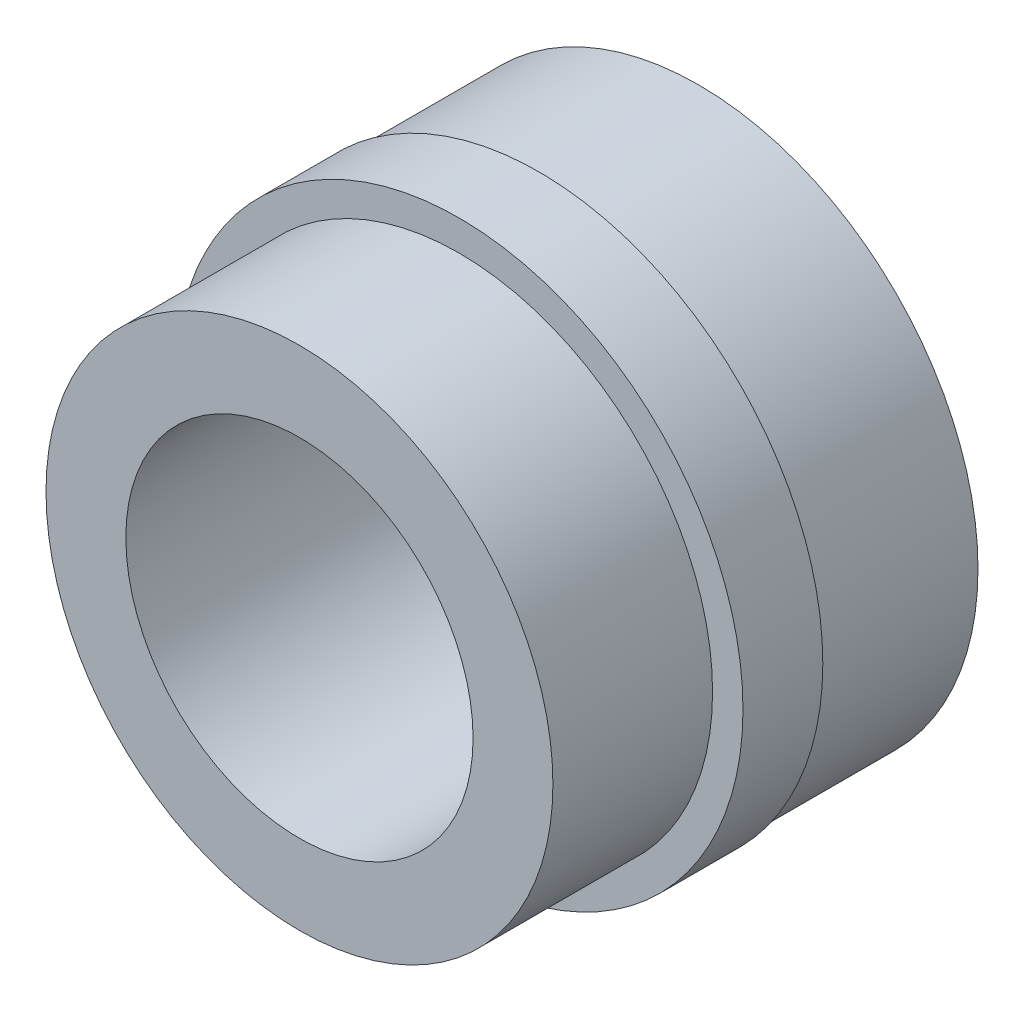
ISO-10303-21;
HEADER;
FILE_DESCRIPTION(('STEP AP214'),'2;1');
FILE_NAME('part.step','',(''),(''),'','','');
FILE_SCHEMA(('AUTOMOTIVE_DESIGN { 1 0 10303 214 1 1 1 1 }'));
ENDSEC;
DATA;
#1=APPLICATION_CONTEXT('core data for automotive mechanical design processes');
#2=APPLICATION_PROTOCOL_DEFINITION('international standard','automotive_design',2000,#1);
#3=PRODUCT_CONTEXT('',#1,'mechanical');
#4=PRODUCT('Part','Part','',(#3));
#5=PRODUCT_RELATED_PRODUCT_CATEGORY('part','',(#4));
#6=PRODUCT_DEFINITION_FORMATION('','',#4);
#7=PRODUCT_DEFINITION_CONTEXT('part definition',#1,'design');
#8=PRODUCT_DEFINITION('design','',#6,#7);
#9=PRODUCT_DEFINITION_SHAPE('','',#8);
#10=(LENGTH_UNIT() NAMED_UNIT(*) SI_UNIT(.MILLI.,.METRE.));
#11=(NAMED_UNIT(*) PLANE_ANGLE_UNIT() SI_UNIT($,.RADIAN.));
#12=(NAMED_UNIT(*) SI_UNIT($,.STERADIAN.) SOLID_ANGLE_UNIT());
#13=UNCERTAINTY_MEASURE_WITH_UNIT(LENGTH_MEASURE(1.E-05),#10,'distance_accuracy_value','');
#14=(GEOMETRIC_REPRESENTATION_CONTEXT(3) GLOBAL_UNCERTAINTY_ASSIGNED_CONTEXT((#13)) GLOBAL_UNIT_ASSIGNED_CONTEXT((#10,
#11,#12)) REPRESENTATION_CONTEXT('',''));
#15=CARTESIAN_POINT('',(0.,0.,0.));
#16=DIRECTION('',(0.,0.,1.));
#17=DIRECTION('',(1.,0.,0.));
#18=AXIS2_PLACEMENT_3D('',#15,#16,#17);
#19=CARTESIAN_POINT('',(0.,0.,52.0138230647709));
#20=DIRECTION('',(0.,0.,1.));
#21=DIRECTION('',(1.,0.,0.));
#22=AXIS2_PLACEMENT_3D('',#19,#20,#21);
#23=CYLINDRICAL_SURFACE('',#22,9.525);
#24=CARTESIAN_POINT('',(0.,0.,5.99999999999995));
#25=DIRECTION('',(0.,0.,1.));
#26=DIRECTION('',(1.,0.,0.));
#27=AXIS2_PLACEMENT_3D('',#24,#25,#26);
#28=CIRCLE('',#27,9.525);
#29=CARTESIAN_POINT('',(9.525,0.,5.99999999999995));
#30=VERTEX_POINT('',#29);
#31=EDGE_CURVE('E10',#30,#30,#28,.T.);
#32=ORIENTED_EDGE('',*,*,#31,.F.);
#33=EDGE_LOOP('',(#32));
#34=FACE_BOUND('',#33,.T.);
#35=CARTESIAN_POINT('',(0.,0.,0.));
#36=DIRECTION('',(0.,0.,1.));
#37=DIRECTION('',(1.,0.,0.));
#38=AXIS2_PLACEMENT_3D('',#35,#36,#37);
#39=CIRCLE('',#38,9.525);
#40=CARTESIAN_POINT('',(9.525,0.,0.));
#41=VERTEX_POINT('',#40);
#42=EDGE_CURVE('E58',#41,#41,#39,.T.);
#43=ORIENTED_EDGE('',*,*,#42,.T.);
#44=EDGE_LOOP('',(#43));
#45=FACE_BOUND('',#44,.T.);
#46=ADVANCED_FACE('F30',(#34,#45),#23,.T.);
#47=CARTESIAN_POINT('',(0.,6.52499999999978,6.00000000000001));
#48=DIRECTION('',(0.,0.,-1.));
#49=DIRECTION('',(-1.,0.,0.));
#50=AXIS2_PLACEMENT_3D('',#47,#48,#49);
#51=PLANE('',#50);
#52=CARTESIAN_POINT('',(0.,0.,5.99999999999995));
#53=DIRECTION('',(0.,0.,1.));
#54=DIRECTION('',(1.,0.,0.));
#55=AXIS2_PLACEMENT_3D('',#52,#53,#54);
#56=CIRCLE('',#55,6.525);
#57=CARTESIAN_POINT('',(6.525,0.,5.99999999999995));
#58=VERTEX_POINT('',#57);
#59=EDGE_CURVE('E36',#58,#58,#56,.T.);
#60=ORIENTED_EDGE('',*,*,#59,.F.);
#61=EDGE_LOOP('',(#60));
#62=FACE_BOUND('',#61,.T.);
#63=ORIENTED_EDGE('',*,*,#31,.T.);
#64=EDGE_LOOP('',(#63));
#65=FACE_BOUND('',#64,.T.);
#66=ADVANCED_FACE('F95',(#62,#65),#51,.F.);
#67=CARTESIAN_POINT('',(0.,0.,52.0138230647709));
#68=DIRECTION('',(0.,0.,1.));
#69=DIRECTION('',(1.,0.,0.));
#70=AXIS2_PLACEMENT_3D('',#67,#68,#69);
#71=CYLINDRICAL_SURFACE('',#70,6.525);
#72=CARTESIAN_POINT('',(0.,0.,-9.00000000000001));
#73=DIRECTION('',(0.,0.,1.));
#74=DIRECTION('',(1.,0.,0.));
#75=AXIS2_PLACEMENT_3D('',#72,#73,#74);
#76=CIRCLE('',#75,6.525);
#77=CARTESIAN_POINT('',(6.525,0.,-9.00000000000001));
#78=VERTEX_POINT('',#77);
#79=EDGE_CURVE('E40',#78,#78,#76,.T.);
#80=ORIENTED_EDGE('',*,*,#79,.F.);
#81=EDGE_LOOP('',(#80));
#82=FACE_BOUND('',#81,.T.);
#83=ORIENTED_EDGE('',*,*,#59,.T.);
#84=EDGE_LOOP('',(#83));
#85=FACE_BOUND('',#84,.T.);
#86=ADVANCED_FACE('F90',(#82,#85),#71,.F.);
#87=CARTESIAN_POINT('',(0.,10.4999999999998,-9.00000000000006));
#88=DIRECTION('',(0.,0.,1.));
#89=DIRECTION('',(1.,0.,0.));
#90=AXIS2_PLACEMENT_3D('',#87,#88,#89);
#91=PLANE('',#90);
#92=CARTESIAN_POINT('',(0.,0.,-9.00000000000001));
#93=DIRECTION('',(0.,0.,1.));
#94=DIRECTION('',(1.,0.,0.));
#95=AXIS2_PLACEMENT_3D('',#92,#93,#94);
#96=CIRCLE('',#95,10.5);
#97=CARTESIAN_POINT('',(10.5,0.,-9.00000000000001));
#98=VERTEX_POINT('',#97);
#99=EDGE_CURVE('E44',#98,#98,#96,.T.);
#100=ORIENTED_EDGE('',*,*,#99,.F.);
#101=EDGE_LOOP('',(#100));
#102=FACE_BOUND('',#101,.T.);
#103=ORIENTED_EDGE('',*,*,#79,.T.);
#104=EDGE_LOOP('',(#103));
#105=FACE_BOUND('',#104,.T.);
#106=ADVANCED_FACE('F84',(#102,#105),#91,.F.);
#107=CARTESIAN_POINT('',(0.,0.,52.0138230647709));
#108=DIRECTION('',(0.,0.,1.));
#109=DIRECTION('',(1.,0.,0.));
#110=AXIS2_PLACEMENT_3D('',#107,#108,#109);
#111=CYLINDRICAL_SURFACE('',#110,10.5);
#112=CARTESIAN_POINT('',(0.,0.,-3.00000000000006));
#113=DIRECTION('',(0.,0.,1.));
#114=DIRECTION('',(1.,0.,0.));
#115=AXIS2_PLACEMENT_3D('',#112,#113,#114);
#116=CIRCLE('',#115,10.5);
#117=CARTESIAN_POINT('',(10.5,0.,-3.00000000000006));
#118=VERTEX_POINT('',#117);
#119=EDGE_CURVE('E49',#118,#118,#116,.T.);
#120=ORIENTED_EDGE('',*,*,#119,.F.);
#121=EDGE_LOOP('',(#120));
#122=FACE_BOUND('',#121,.T.);
#123=ORIENTED_EDGE('',*,*,#99,.T.);
#124=EDGE_LOOP('',(#123));
#125=FACE_BOUND('',#124,.T.);
#126=ADVANCED_FACE('F78',(#122,#125),#111,.T.);
#127=CARTESIAN_POINT('',(0.,10.668,-3.00000000000006));
#128=DIRECTION('',(0.,0.,1.));
#129=DIRECTION('',(1.,0.,0.));
#130=AXIS2_PLACEMENT_3D('',#127,#128,#129);
#131=PLANE('',#130);
#132=CARTESIAN_POINT('',(0.,0.,-3.00000000000006));
#133=DIRECTION('',(0.,0.,1.));
#134=DIRECTION('',(1.,0.,0.));
#135=AXIS2_PLACEMENT_3D('',#132,#133,#134);
#136=CIRCLE('',#135,10.668);
#137=CARTESIAN_POINT('',(10.668,0.,-3.00000000000006));
#138=VERTEX_POINT('',#137);
#139=EDGE_CURVE('E52',#138,#138,#136,.T.);
#140=ORIENTED_EDGE('',*,*,#139,.F.);
#141=EDGE_LOOP('',(#140));
#142=FACE_BOUND('',#141,.T.);
#143=ORIENTED_EDGE('',*,*,#119,.T.);
#144=EDGE_LOOP('',(#143));
#145=FACE_BOUND('',#144,.T.);
#146=ADVANCED_FACE('F72',(#142,#145),#131,.F.);
#147=CARTESIAN_POINT('',(0.,0.,52.0138230647709));
#148=DIRECTION('',(0.,0.,1.));
#149=DIRECTION('',(1.,0.,0.));
#150=AXIS2_PLACEMENT_3D('',#147,#148,#149);
#151=CYLINDRICAL_SURFACE('',#150,10.668);
#152=CARTESIAN_POINT('',(0.,0.,0.));
#153=DIRECTION('',(0.,0.,1.));
#154=DIRECTION('',(1.,0.,0.));
#155=AXIS2_PLACEMENT_3D('',#152,#153,#154);
#156=CIRCLE('',#155,10.668);
#157=CARTESIAN_POINT('',(10.668,0.,0.));
#158=VERTEX_POINT('',#157);
#159=EDGE_CURVE('E55',#158,#158,#156,.T.);
#160=ORIENTED_EDGE('',*,*,#159,.F.);
#161=EDGE_LOOP('',(#160));
#162=FACE_BOUND('',#161,.T.);
#163=ORIENTED_EDGE('',*,*,#139,.T.);
#164=EDGE_LOOP('',(#163));
#165=FACE_BOUND('',#164,.T.);
#166=ADVANCED_FACE('F66',(#162,#165),#151,.T.);
#167=CARTESIAN_POINT('',(0.,9.52500000000001,0.));
#168=DIRECTION('',(0.,0.,-1.));
#169=DIRECTION('',(-1.,0.,0.));
#170=AXIS2_PLACEMENT_3D('',#167,#168,#169);
#171=PLANE('',#170);
#172=ORIENTED_EDGE('',*,*,#42,.F.);
#173=EDGE_LOOP('',(#172));
#174=FACE_BOUND('',#173,.T.);
#175=ORIENTED_EDGE('',*,*,#159,.T.);
#176=EDGE_LOOP('',(#175));
#177=FACE_BOUND('',#176,.T.);
#178=ADVANCED_FACE('F63',(#174,#177),#171,.F.);
#179=CLOSED_SHELL('',(#46,#66,#86,#106,#126,#146,#166,#178));
#180=MANIFOLD_SOLID_BREP('B2',#179);
#181=ADVANCED_BREP_SHAPE_REPRESENTATION('',(#18,#180),#14);
#182=SHAPE_DEFINITION_REPRESENTATION(#9,#181);
ENDSEC;
END-ISO-10303-21;
